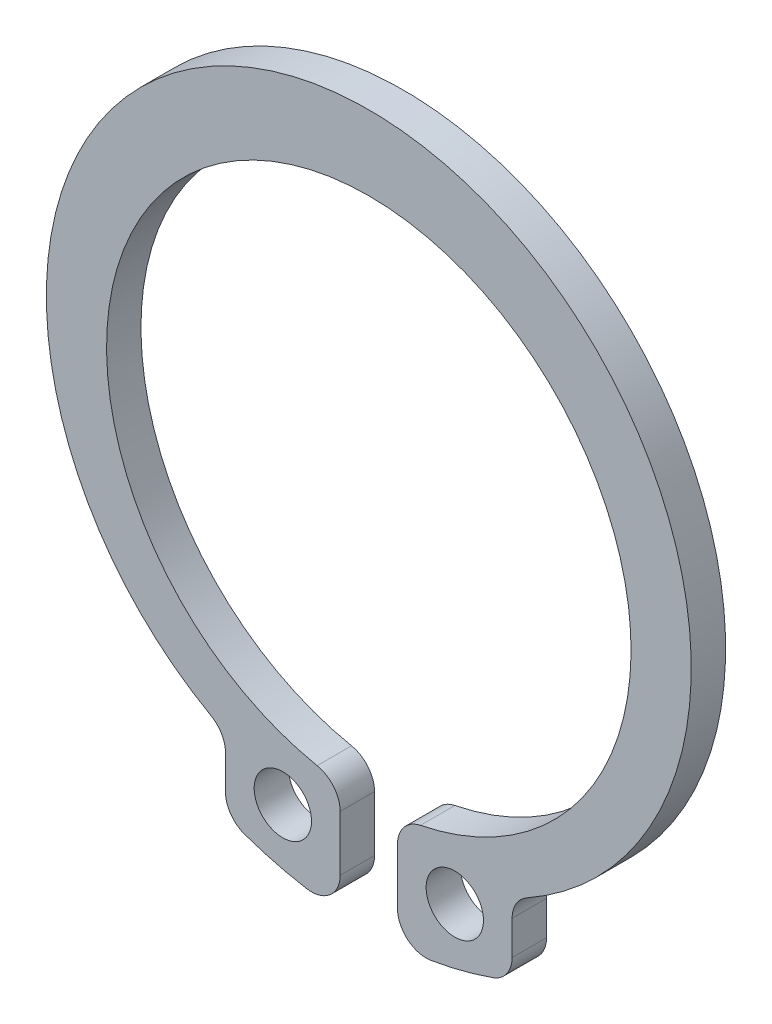
ISO-10303-21;
HEADER;
FILE_DESCRIPTION(('STEP AP214'),'2;1');
FILE_NAME('part.step','',(''),(''),'','','');
FILE_SCHEMA(('AUTOMOTIVE_DESIGN { 1 0 10303 214 1 1 1 1 }'));
ENDSEC;
DATA;
#1=APPLICATION_CONTEXT('core data for automotive mechanical design processes');
#2=APPLICATION_PROTOCOL_DEFINITION('international standard','automotive_design',2000,#1);
#3=PRODUCT_CONTEXT('',#1,'mechanical');
#4=PRODUCT('Part','Part','',(#3));
#5=PRODUCT_RELATED_PRODUCT_CATEGORY('part','',(#4));
#6=PRODUCT_DEFINITION_FORMATION('','',#4);
#7=PRODUCT_DEFINITION_CONTEXT('part definition',#1,'design');
#8=PRODUCT_DEFINITION('design','',#6,#7);
#9=PRODUCT_DEFINITION_SHAPE('','',#8);
#10=(LENGTH_UNIT() NAMED_UNIT(*) SI_UNIT(.MILLI.,.METRE.));
#11=(NAMED_UNIT(*) PLANE_ANGLE_UNIT() SI_UNIT($,.RADIAN.));
#12=(NAMED_UNIT(*) SI_UNIT($,.STERADIAN.) SOLID_ANGLE_UNIT());
#13=UNCERTAINTY_MEASURE_WITH_UNIT(LENGTH_MEASURE(1.E-05),#10,'distance_accuracy_value','');
#14=(GEOMETRIC_REPRESENTATION_CONTEXT(3) GLOBAL_UNCERTAINTY_ASSIGNED_CONTEXT((#13)) GLOBAL_UNIT_ASSIGNED_CONTEXT((#10,
#11,#12)) REPRESENTATION_CONTEXT('',''));
#15=CARTESIAN_POINT('',(0.,0.,0.));
#16=DIRECTION('',(0.,0.,1.));
#17=DIRECTION('',(1.,0.,0.));
#18=AXIS2_PLACEMENT_3D('',#15,#16,#17);
#19=CARTESIAN_POINT('',(0.,-0.582120503815602,1.2));
#20=DIRECTION('',(0.,0.,1.));
#21=DIRECTION('',(1.,0.,0.));
#22=AXIS2_PLACEMENT_3D('',#19,#20,#21);
#23=PLANE('',#22);
#24=CARTESIAN_POINT('',(-4.,-11.3667277613216,1.2));
#25=DIRECTION('',(0.,0.,1.));
#26=DIRECTION('',(1.,0.,0.));
#27=AXIS2_PLACEMENT_3D('',#24,#25,#26);
#28=CIRCLE('',#27,1.);
#29=CARTESIAN_POINT('',(-4.33195020746889,-12.3100246709749,1.2));
#30=VERTEX_POINT('',#29);
#31=CARTESIAN_POINT('',(-5.,-11.3667277613216,1.2));
#32=VERTEX_POINT('',#31);
#33=EDGE_CURVE('E217',#30,#32,#28,.F.);
#34=ORIENTED_EDGE('',*,*,#33,.F.);
#35=CARTESIAN_POINT('',(0.,0.,1.2));
#36=DIRECTION('',(0.,0.,1.));
#37=DIRECTION('',(1.,0.,0.));
#38=AXIS2_PLACEMENT_3D('',#35,#36,#37);
#39=CIRCLE('',#38,13.05);
#40=CARTESIAN_POINT('',(-2.16597510373444,-12.8689957591881,1.2));
#41=VERTEX_POINT('',#40);
#42=EDGE_CURVE('E214',#41,#30,#39,.F.);
#43=ORIENTED_EDGE('',*,*,#42,.F.);
#44=CARTESIAN_POINT('',(-2.,-11.8828658159553,1.2));
#45=DIRECTION('',(0.,0.,1.));
#46=DIRECTION('',(1.,0.,0.));
#47=AXIS2_PLACEMENT_3D('',#44,#45,#46);
#48=CIRCLE('',#47,1.);
#49=CARTESIAN_POINT('',(-0.999999999999999,-11.8828658159553,1.2));
#50=VERTEX_POINT('',#49);
#51=EDGE_CURVE('E211',#50,#41,#48,.F.);
#52=ORIENTED_EDGE('',*,*,#51,.F.);
#53=DIRECTION('',(0.,1.,0.));
#54=VECTOR('',#53,1.);
#55=CARTESIAN_POINT('',(-0.999999999999999,-11.8828658159553,1.2));
#56=LINE('',#55,#54);
#57=CARTESIAN_POINT('',(-0.999999999999999,-9.95100497437319,1.2));
#58=VERTEX_POINT('',#57);
#59=EDGE_CURVE('E144',#58,#50,#56,.F.);
#60=ORIENTED_EDGE('',*,*,#59,.F.);
#61=CARTESIAN_POINT('',(-2.,-9.95100497437319,1.2));
#62=DIRECTION('',(0.,0.,1.));
#63=DIRECTION('',(1.,0.,0.));
#64=AXIS2_PLACEMENT_3D('',#61,#62,#63);
#65=CIRCLE('',#64,1.);
#66=CARTESIAN_POINT('',(-1.80295566502463,-8.97061039561721,1.2));
#67=VERTEX_POINT('',#66);
#68=EDGE_CURVE('E140',#67,#58,#65,.F.);
#69=ORIENTED_EDGE('',*,*,#68,.F.);
#70=CARTESIAN_POINT('',(0.,0.,1.2));
#71=DIRECTION('',(0.,0.,1.));
#72=DIRECTION('',(1.,0.,0.));
#73=AXIS2_PLACEMENT_3D('',#70,#71,#72);
#74=CIRCLE('',#73,9.15);
#75=CARTESIAN_POINT('',(1.80295566502463,-8.97061039561721,1.2));
#76=VERTEX_POINT('',#75);
#77=EDGE_CURVE('E126',#67,#76,#74,.F.);
#78=ORIENTED_EDGE('',*,*,#77,.T.);
#79=CARTESIAN_POINT('',(2.,-9.95100497437319,1.2));
#80=DIRECTION('',(0.,0.,1.));
#81=DIRECTION('',(1.,0.,0.));
#82=AXIS2_PLACEMENT_3D('',#79,#80,#81);
#83=CIRCLE('',#82,1.);
#84=CARTESIAN_POINT('',(1.,-9.95100497437319,1.2));
#85=VERTEX_POINT('',#84);
#86=EDGE_CURVE('E136',#85,#76,#83,.F.);
#87=ORIENTED_EDGE('',*,*,#86,.F.);
#88=DIRECTION('',(0.,-1.,0.));
#89=VECTOR('',#88,1.);
#90=CARTESIAN_POINT('',(1.,-9.95100497437319,1.2));
#91=LINE('',#90,#89);
#92=CARTESIAN_POINT('',(1.,-11.8828658159553,1.2));
#93=VERTEX_POINT('',#92);
#94=EDGE_CURVE('E167',#93,#85,#91,.F.);
#95=ORIENTED_EDGE('',*,*,#94,.F.);
#96=CARTESIAN_POINT('',(2.,-11.8828658159553,1.2));
#97=DIRECTION('',(0.,0.,1.));
#98=DIRECTION('',(1.,0.,0.));
#99=AXIS2_PLACEMENT_3D('',#96,#97,#98);
#100=CIRCLE('',#99,0.999999999999999);
#101=CARTESIAN_POINT('',(2.16597510373444,-12.8689957591882,1.2));
#102=VERTEX_POINT('',#101);
#103=EDGE_CURVE('E235',#102,#93,#100,.F.);
#104=ORIENTED_EDGE('',*,*,#103,.F.);
#105=CARTESIAN_POINT('',(0.,0.,1.2));
#106=DIRECTION('',(0.,0.,1.));
#107=DIRECTION('',(1.,0.,0.));
#108=AXIS2_PLACEMENT_3D('',#105,#106,#107);
#109=CIRCLE('',#108,13.05);
#110=CARTESIAN_POINT('',(4.33195020746888,-12.3100246709749,1.2));
#111=VERTEX_POINT('',#110);
#112=EDGE_CURVE('E232',#111,#102,#109,.F.);
#113=ORIENTED_EDGE('',*,*,#112,.F.);
#114=CARTESIAN_POINT('',(4.,-11.3667277613216,1.2));
#115=DIRECTION('',(0.,0.,1.));
#116=DIRECTION('',(1.,0.,0.));
#117=AXIS2_PLACEMENT_3D('',#114,#115,#116);
#118=CIRCLE('',#117,1.);
#119=CARTESIAN_POINT('',(5.,-11.3667277613216,1.2));
#120=VERTEX_POINT('',#119);
#121=EDGE_CURVE('E229',#120,#111,#118,.F.);
#122=ORIENTED_EDGE('',*,*,#121,.F.);
#123=DIRECTION('',(0.,1.,0.));
#124=VECTOR('',#123,1.);
#125=CARTESIAN_POINT('',(5.,-11.3667277613216,1.2));
#126=LINE('',#125,#124);
#127=CARTESIAN_POINT('',(5.,-10.1800046816469,1.2));
#128=VERTEX_POINT('',#127);
#129=EDGE_CURVE('E163',#128,#120,#126,.F.);
#130=ORIENTED_EDGE('',*,*,#129,.F.);
#131=CARTESIAN_POINT('',(6.,-10.1800046816469,1.2));
#132=DIRECTION('',(0.,0.,1.));
#133=DIRECTION('',(1.,0.,0.));
#134=AXIS2_PLACEMENT_3D('',#131,#132,#133);
#135=CIRCLE('',#134,1.);
#136=CARTESIAN_POINT('',(5.51020408163266,-9.30816756477778,1.2));
#137=VERTEX_POINT('',#136);
#138=EDGE_CURVE('E225',#128,#137,#135,.F.);
#139=ORIENTED_EDGE('',*,*,#138,.T.);
#140=CARTESIAN_POINT('',(0.,0.5,1.2));
#141=DIRECTION('',(0.,0.,1.));
#142=DIRECTION('',(1.,0.,0.));
#143=AXIS2_PLACEMENT_3D('',#140,#141,#142);
#144=CIRCLE('',#143,11.25);
#145=CARTESIAN_POINT('',(-5.51020408163265,-9.30816756477777,1.2));
#146=VERTEX_POINT('',#145);
#147=EDGE_CURVE('E222',#146,#137,#144,.F.);
#148=ORIENTED_EDGE('',*,*,#147,.F.);
#149=CARTESIAN_POINT('',(-6.,-10.1800046816469,1.2));
#150=DIRECTION('',(0.,0.,1.));
#151=DIRECTION('',(1.,0.,0.));
#152=AXIS2_PLACEMENT_3D('',#149,#150,#151);
#153=CIRCLE('',#152,1.);
#154=CARTESIAN_POINT('',(-5.,-10.1800046816469,1.2));
#155=VERTEX_POINT('',#154);
#156=EDGE_CURVE('E162',#146,#155,#153,.F.);
#157=ORIENTED_EDGE('',*,*,#156,.T.);
#158=DIRECTION('',(0.,-1.,0.));
#159=VECTOR('',#158,1.);
#160=CARTESIAN_POINT('',(-5.,-10.1800046816469,1.2));
#161=LINE('',#160,#159);
#162=EDGE_CURVE('E159',#32,#155,#161,.F.);
#163=ORIENTED_EDGE('',*,*,#162,.F.);
#164=EDGE_LOOP('',(#34,#43,#52,#60,#69,#78,#87,#95,#104,#113,#122,#130,#139,#148,#157,#163));
#165=FACE_BOUND('',#164,.T.);
#166=CARTESIAN_POINT('',(3.,-10.75,1.2));
#167=DIRECTION('',(0.,0.,1.));
#168=DIRECTION('',(1.,0.,0.));
#169=AXIS2_PLACEMENT_3D('',#166,#167,#168);
#170=CIRCLE('',#169,1.);
#171=CARTESIAN_POINT('',(4.,-10.75,1.2));
#172=VERTEX_POINT('',#171);
#173=EDGE_CURVE('E148',#172,#172,#170,.F.);
#174=ORIENTED_EDGE('',*,*,#173,.T.);
#175=EDGE_LOOP('',(#174));
#176=FACE_BOUND('',#175,.T.);
#177=CARTESIAN_POINT('',(-3.,-10.75,1.2));
#178=DIRECTION('',(0.,0.,1.));
#179=DIRECTION('',(1.,0.,0.));
#180=AXIS2_PLACEMENT_3D('',#177,#178,#179);
#181=CIRCLE('',#180,1.);
#182=CARTESIAN_POINT('',(-2.,-10.75,1.2));
#183=VERTEX_POINT('',#182);
#184=EDGE_CURVE('E20',#183,#183,#181,.F.);
#185=ORIENTED_EDGE('',*,*,#184,.T.);
#186=EDGE_LOOP('',(#185));
#187=FACE_BOUND('',#186,.T.);
#188=ADVANCED_FACE('F17',(#165,#176,#187),#23,.T.);
#189=CARTESIAN_POINT('',(-3.,-10.75,0.));
#190=DIRECTION('',(0.,0.,1.));
#191=DIRECTION('',(1.,0.,0.));
#192=AXIS2_PLACEMENT_3D('',#189,#190,#191);
#193=CYLINDRICAL_SURFACE('',#192,1.);
#194=ORIENTED_EDGE('',*,*,#184,.F.);
#195=EDGE_LOOP('',(#194));
#196=FACE_BOUND('',#195,.T.);
#197=CARTESIAN_POINT('',(-3.,-10.75,0.));
#198=DIRECTION('',(0.,0.,1.));
#199=DIRECTION('',(1.,0.,0.));
#200=AXIS2_PLACEMENT_3D('',#197,#198,#199);
#201=CIRCLE('',#200,1.);
#202=CARTESIAN_POINT('',(-2.,-10.75,0.));
#203=VERTEX_POINT('',#202);
#204=EDGE_CURVE('E207',#203,#203,#201,.F.);
#205=ORIENTED_EDGE('',*,*,#204,.T.);
#206=EDGE_LOOP('',(#205));
#207=FACE_BOUND('',#206,.T.);
#208=ADVANCED_FACE('F243',(#196,#207),#193,.F.);
#209=CARTESIAN_POINT('',(3.,-10.75,0.));
#210=DIRECTION('',(0.,0.,1.));
#211=DIRECTION('',(1.,0.,0.));
#212=AXIS2_PLACEMENT_3D('',#209,#210,#211);
#213=CYLINDRICAL_SURFACE('',#212,1.);
#214=ORIENTED_EDGE('',*,*,#173,.F.);
#215=EDGE_LOOP('',(#214));
#216=FACE_BOUND('',#215,.T.);
#217=CARTESIAN_POINT('',(3.,-10.75,0.));
#218=DIRECTION('',(0.,0.,1.));
#219=DIRECTION('',(1.,0.,0.));
#220=AXIS2_PLACEMENT_3D('',#217,#218,#219);
#221=CIRCLE('',#220,1.);
#222=CARTESIAN_POINT('',(4.,-10.75,0.));
#223=VERTEX_POINT('',#222);
#224=EDGE_CURVE('E204',#223,#223,#221,.F.);
#225=ORIENTED_EDGE('',*,*,#224,.T.);
#226=EDGE_LOOP('',(#225));
#227=FACE_BOUND('',#226,.T.);
#228=ADVANCED_FACE('F246',(#216,#227),#213,.F.);
#229=CARTESIAN_POINT('',(-2.,-9.95100497437319,0.));
#230=DIRECTION('',(0.,0.,1.));
#231=DIRECTION('',(1.,0.,0.));
#232=AXIS2_PLACEMENT_3D('',#229,#230,#231);
#233=CYLINDRICAL_SURFACE('',#232,1.);
#234=CARTESIAN_POINT('',(-2.,-9.95100497437319,0.));
#235=DIRECTION('',(0.,0.,1.));
#236=DIRECTION('',(1.,0.,0.));
#237=AXIS2_PLACEMENT_3D('',#234,#235,#236);
#238=CIRCLE('',#237,1.);
#239=CARTESIAN_POINT('',(-0.999999999999999,-9.95100497437319,0.));
#240=VERTEX_POINT('',#239);
#241=CARTESIAN_POINT('',(-1.80295566502463,-8.97061039561721,0.));
#242=VERTEX_POINT('',#241);
#243=EDGE_CURVE('E152',#240,#242,#238,.T.);
#244=ORIENTED_EDGE('',*,*,#243,.T.);
#245=DIRECTION('',(0.,0.,1.));
#246=VECTOR('',#245,1.);
#247=CARTESIAN_POINT('',(-1.80295566502464,-8.97061039561721,0.));
#248=LINE('',#247,#246);
#249=EDGE_CURVE('E130',#242,#67,#248,.T.);
#250=ORIENTED_EDGE('',*,*,#249,.T.);
#251=ORIENTED_EDGE('',*,*,#68,.T.);
#252=DIRECTION('',(0.,0.,1.));
#253=VECTOR('',#252,1.);
#254=CARTESIAN_POINT('',(-0.999999999999999,-9.95100497437319,0.));
#255=LINE('',#254,#253);
#256=EDGE_CURVE('E210',#240,#58,#255,.T.);
#257=ORIENTED_EDGE('',*,*,#256,.F.);
#258=EDGE_LOOP('',(#244,#250,#251,#257));
#259=FACE_BOUND('',#258,.T.);
#260=ADVANCED_FACE('F151',(#259),#233,.T.);
#261=CARTESIAN_POINT('',(0.,0.,0.));
#262=DIRECTION('',(0.,0.,1.));
#263=DIRECTION('',(1.,0.,0.));
#264=AXIS2_PLACEMENT_3D('',#261,#262,#263);
#265=CYLINDRICAL_SURFACE('',#264,9.15);
#266=CARTESIAN_POINT('',(0.,0.,0.));
#267=DIRECTION('',(0.,0.,1.));
#268=DIRECTION('',(1.,0.,0.));
#269=AXIS2_PLACEMENT_3D('',#266,#267,#268);
#270=CIRCLE('',#269,9.15);
#271=CARTESIAN_POINT('',(1.80295566502463,-8.97061039561721,0.));
#272=VERTEX_POINT('',#271);
#273=EDGE_CURVE('E201',#242,#272,#270,.F.);
#274=ORIENTED_EDGE('',*,*,#273,.T.);
#275=DIRECTION('',(0.,0.,1.));
#276=VECTOR('',#275,1.);
#277=CARTESIAN_POINT('',(1.80295566502463,-8.97061039561721,0.));
#278=LINE('',#277,#276);
#279=EDGE_CURVE('E133',#76,#272,#278,.F.);
#280=ORIENTED_EDGE('',*,*,#279,.F.);
#281=ORIENTED_EDGE('',*,*,#77,.F.);
#282=ORIENTED_EDGE('',*,*,#249,.F.);
#283=EDGE_LOOP('',(#274,#280,#281,#282));
#284=FACE_BOUND('',#283,.T.);
#285=ADVANCED_FACE('F128',(#284),#265,.F.);
#286=CARTESIAN_POINT('',(2.,-9.95100497437319,0.));
#287=DIRECTION('',(0.,0.,1.));
#288=DIRECTION('',(1.,0.,0.));
#289=AXIS2_PLACEMENT_3D('',#286,#287,#288);
#290=CYLINDRICAL_SURFACE('',#289,1.);
#291=CARTESIAN_POINT('',(2.,-9.95100497437319,0.));
#292=DIRECTION('',(0.,0.,1.));
#293=DIRECTION('',(1.,0.,0.));
#294=AXIS2_PLACEMENT_3D('',#291,#292,#293);
#295=CIRCLE('',#294,1.);
#296=CARTESIAN_POINT('',(1.,-9.95100497437319,0.));
#297=VERTEX_POINT('',#296);
#298=EDGE_CURVE('E198',#272,#297,#295,.T.);
#299=ORIENTED_EDGE('',*,*,#298,.T.);
#300=DIRECTION('',(0.,0.,1.));
#301=VECTOR('',#300,1.);
#302=CARTESIAN_POINT('',(1.,-9.95100497437319,0.));
#303=LINE('',#302,#301);
#304=EDGE_CURVE('E169',#85,#297,#303,.F.);
#305=ORIENTED_EDGE('',*,*,#304,.F.);
#306=ORIENTED_EDGE('',*,*,#86,.T.);
#307=ORIENTED_EDGE('',*,*,#279,.T.);
#308=EDGE_LOOP('',(#299,#305,#306,#307));
#309=FACE_BOUND('',#308,.T.);
#310=ADVANCED_FACE('F309',(#309),#290,.T.);
#311=CARTESIAN_POINT('',(1.,-9.95100497437319,0.));
#312=DIRECTION('',(-1.,0.,0.));
#313=DIRECTION('',(0.,-1.,0.));
#314=AXIS2_PLACEMENT_3D('',#311,#312,#313);
#315=PLANE('',#314);
#316=DIRECTION('',(0.,1.,0.));
#317=VECTOR('',#316,1.);
#318=CARTESIAN_POINT('',(1.,-0.582120503815602,0.));
#319=LINE('',#318,#317);
#320=CARTESIAN_POINT('',(1.,-11.8828658159553,0.));
#321=VERTEX_POINT('',#320);
#322=EDGE_CURVE('E197',#297,#321,#319,.F.);
#323=ORIENTED_EDGE('',*,*,#322,.T.);
#324=DIRECTION('',(0.,0.,1.));
#325=VECTOR('',#324,1.);
#326=CARTESIAN_POINT('',(1.,-11.8828658159553,0.));
#327=LINE('',#326,#325);
#328=EDGE_CURVE('E234',#93,#321,#327,.F.);
#329=ORIENTED_EDGE('',*,*,#328,.F.);
#330=ORIENTED_EDGE('',*,*,#94,.T.);
#331=ORIENTED_EDGE('',*,*,#304,.T.);
#332=EDGE_LOOP('',(#323,#329,#330,#331));
#333=FACE_BOUND('',#332,.T.);
#334=ADVANCED_FACE('F305',(#333),#315,.T.);
#335=CARTESIAN_POINT('',(2.,-11.8828658159553,0.));
#336=DIRECTION('',(0.,0.,1.));
#337=DIRECTION('',(1.,0.,0.));
#338=AXIS2_PLACEMENT_3D('',#335,#336,#337);
#339=CYLINDRICAL_SURFACE('',#338,0.999999999999999);
#340=CARTESIAN_POINT('',(2.,-11.8828658159553,0.));
#341=DIRECTION('',(0.,0.,1.));
#342=DIRECTION('',(1.,0.,0.));
#343=AXIS2_PLACEMENT_3D('',#340,#341,#342);
#344=CIRCLE('',#343,0.999999999999999);
#345=CARTESIAN_POINT('',(2.16597510373444,-12.8689957591882,0.));
#346=VERTEX_POINT('',#345);
#347=EDGE_CURVE('E194',#321,#346,#344,.T.);
#348=ORIENTED_EDGE('',*,*,#347,.T.);
#349=DIRECTION('',(0.,0.,1.));
#350=VECTOR('',#349,1.);
#351=CARTESIAN_POINT('',(2.16597510373444,-12.8689957591882,0.));
#352=LINE('',#351,#350);
#353=EDGE_CURVE('E231',#102,#346,#352,.F.);
#354=ORIENTED_EDGE('',*,*,#353,.F.);
#355=ORIENTED_EDGE('',*,*,#103,.T.);
#356=ORIENTED_EDGE('',*,*,#328,.T.);
#357=EDGE_LOOP('',(#348,#354,#355,#356));
#358=FACE_BOUND('',#357,.T.);
#359=ADVANCED_FACE('F301',(#358),#339,.T.);
#360=CARTESIAN_POINT('',(0.,0.,0.));
#361=DIRECTION('',(0.,0.,1.));
#362=DIRECTION('',(1.,0.,0.));
#363=AXIS2_PLACEMENT_3D('',#360,#361,#362);
#364=CYLINDRICAL_SURFACE('',#363,13.05);
#365=CARTESIAN_POINT('',(0.,0.,0.));
#366=DIRECTION('',(0.,0.,1.));
#367=DIRECTION('',(1.,0.,0.));
#368=AXIS2_PLACEMENT_3D('',#365,#366,#367);
#369=CIRCLE('',#368,13.05);
#370=CARTESIAN_POINT('',(4.33195020746888,-12.3100246709749,0.));
#371=VERTEX_POINT('',#370);
#372=EDGE_CURVE('E191',#346,#371,#369,.T.);
#373=ORIENTED_EDGE('',*,*,#372,.T.);
#374=DIRECTION('',(0.,0.,1.));
#375=VECTOR('',#374,1.);
#376=CARTESIAN_POINT('',(4.33195020746887,-12.3100246709749,0.));
#377=LINE('',#376,#375);
#378=EDGE_CURVE('E166',#111,#371,#377,.F.);
#379=ORIENTED_EDGE('',*,*,#378,.F.);
#380=ORIENTED_EDGE('',*,*,#112,.T.);
#381=ORIENTED_EDGE('',*,*,#353,.T.);
#382=EDGE_LOOP('',(#373,#379,#380,#381));
#383=FACE_BOUND('',#382,.T.);
#384=ADVANCED_FACE('F297',(#383),#364,.T.);
#385=CARTESIAN_POINT('',(4.,-11.3667277613216,0.));
#386=DIRECTION('',(0.,0.,1.));
#387=DIRECTION('',(1.,0.,0.));
#388=AXIS2_PLACEMENT_3D('',#385,#386,#387);
#389=CYLINDRICAL_SURFACE('',#388,1.);
#390=CARTESIAN_POINT('',(4.,-11.3667277613216,0.));
#391=DIRECTION('',(0.,0.,1.));
#392=DIRECTION('',(1.,0.,0.));
#393=AXIS2_PLACEMENT_3D('',#390,#391,#392);
#394=CIRCLE('',#393,1.);
#395=CARTESIAN_POINT('',(5.,-11.3667277613216,0.));
#396=VERTEX_POINT('',#395);
#397=EDGE_CURVE('E188',#371,#396,#394,.T.);
#398=ORIENTED_EDGE('',*,*,#397,.T.);
#399=DIRECTION('',(0.,0.,1.));
#400=VECTOR('',#399,1.);
#401=CARTESIAN_POINT('',(5.,-11.3667277613216,0.));
#402=LINE('',#401,#400);
#403=EDGE_CURVE('E165',#120,#396,#402,.F.);
#404=ORIENTED_EDGE('',*,*,#403,.F.);
#405=ORIENTED_EDGE('',*,*,#121,.T.);
#406=ORIENTED_EDGE('',*,*,#378,.T.);
#407=EDGE_LOOP('',(#398,#404,#405,#406));
#408=FACE_BOUND('',#407,.T.);
#409=ADVANCED_FACE('F293',(#408),#389,.T.);
#410=CARTESIAN_POINT('',(5.,-11.3667277613216,0.));
#411=DIRECTION('',(1.,0.,0.));
#412=DIRECTION('',(0.,1.,0.));
#413=AXIS2_PLACEMENT_3D('',#410,#411,#412);
#414=PLANE('',#413);
#415=DIRECTION('',(0.,1.,0.));
#416=VECTOR('',#415,1.);
#417=CARTESIAN_POINT('',(5.,-0.582120503815602,0.));
#418=LINE('',#417,#416);
#419=CARTESIAN_POINT('',(5.,-10.1800046816469,0.));
#420=VERTEX_POINT('',#419);
#421=EDGE_CURVE('E187',#396,#420,#418,.T.);
#422=ORIENTED_EDGE('',*,*,#421,.T.);
#423=DIRECTION('',(0.,0.,1.));
#424=VECTOR('',#423,1.);
#425=CARTESIAN_POINT('',(5.,-10.1800046816469,0.));
#426=LINE('',#425,#424);
#427=EDGE_CURVE('E228',#420,#128,#426,.T.);
#428=ORIENTED_EDGE('',*,*,#427,.T.);
#429=ORIENTED_EDGE('',*,*,#129,.T.);
#430=ORIENTED_EDGE('',*,*,#403,.T.);
#431=EDGE_LOOP('',(#422,#428,#429,#430));
#432=FACE_BOUND('',#431,.T.);
#433=ADVANCED_FACE('F289',(#432),#414,.T.);
#434=CARTESIAN_POINT('',(6.,-10.1800046816469,0.));
#435=DIRECTION('',(0.,0.,1.));
#436=DIRECTION('',(1.,0.,0.));
#437=AXIS2_PLACEMENT_3D('',#434,#435,#436);
#438=CYLINDRICAL_SURFACE('',#437,1.);
#439=ORIENTED_EDGE('',*,*,#138,.F.);
#440=ORIENTED_EDGE('',*,*,#427,.F.);
#441=CARTESIAN_POINT('',(6.,-10.1800046816469,0.));
#442=DIRECTION('',(0.,0.,1.));
#443=DIRECTION('',(1.,0.,0.));
#444=AXIS2_PLACEMENT_3D('',#441,#442,#443);
#445=CIRCLE('',#444,1.);
#446=CARTESIAN_POINT('',(5.51020408163266,-9.30816756477778,0.));
#447=VERTEX_POINT('',#446);
#448=EDGE_CURVE('E184',#420,#447,#445,.F.);
#449=ORIENTED_EDGE('',*,*,#448,.T.);
#450=DIRECTION('',(0.,0.,1.));
#451=VECTOR('',#450,1.);
#452=CARTESIAN_POINT('',(5.51020408163265,-9.30816756477778,0.));
#453=LINE('',#452,#451);
#454=EDGE_CURVE('E224',#137,#447,#453,.F.);
#455=ORIENTED_EDGE('',*,*,#454,.F.);
#456=EDGE_LOOP('',(#439,#440,#449,#455));
#457=FACE_BOUND('',#456,.T.);
#458=ADVANCED_FACE('F285',(#457),#438,.F.);
#459=CARTESIAN_POINT('',(0.,0.5,0.));
#460=DIRECTION('',(0.,0.,1.));
#461=DIRECTION('',(1.,0.,0.));
#462=AXIS2_PLACEMENT_3D('',#459,#460,#461);
#463=CYLINDRICAL_SURFACE('',#462,11.25);
#464=DIRECTION('',(0.,0.,1.));
#465=VECTOR('',#464,1.);
#466=CARTESIAN_POINT('',(-5.51020408163265,-9.30816756477777,0.));
#467=LINE('',#466,#465);
#468=CARTESIAN_POINT('',(-5.51020408163265,-9.30816756477777,0.));
#469=VERTEX_POINT('',#468);
#470=EDGE_CURVE('E221',#469,#146,#467,.T.);
#471=ORIENTED_EDGE('',*,*,#470,.T.);
#472=ORIENTED_EDGE('',*,*,#147,.T.);
#473=ORIENTED_EDGE('',*,*,#454,.T.);
#474=CARTESIAN_POINT('',(0.,0.5,0.));
#475=DIRECTION('',(0.,0.,1.));
#476=DIRECTION('',(1.,0.,0.));
#477=AXIS2_PLACEMENT_3D('',#474,#475,#476);
#478=CIRCLE('',#477,11.25);
#479=EDGE_CURVE('E182',#447,#469,#478,.T.);
#480=ORIENTED_EDGE('',*,*,#479,.T.);
#481=EDGE_LOOP('',(#471,#472,#473,#480));
#482=FACE_BOUND('',#481,.T.);
#483=ADVANCED_FACE('F281',(#482),#463,.T.);
#484=CARTESIAN_POINT('',(-6.,-10.1800046816469,0.));
#485=DIRECTION('',(0.,0.,1.));
#486=DIRECTION('',(1.,0.,0.));
#487=AXIS2_PLACEMENT_3D('',#484,#485,#486);
#488=CYLINDRICAL_SURFACE('',#487,1.);
#489=ORIENTED_EDGE('',*,*,#156,.F.);
#490=ORIENTED_EDGE('',*,*,#470,.F.);
#491=CARTESIAN_POINT('',(-6.,-10.1800046816469,0.));
#492=DIRECTION('',(0.,0.,1.));
#493=DIRECTION('',(1.,0.,0.));
#494=AXIS2_PLACEMENT_3D('',#491,#492,#493);
#495=CIRCLE('',#494,1.);
#496=CARTESIAN_POINT('',(-5.,-10.1800046816469,0.));
#497=VERTEX_POINT('',#496);
#498=EDGE_CURVE('E179',#469,#497,#495,.F.);
#499=ORIENTED_EDGE('',*,*,#498,.T.);
#500=DIRECTION('',(0.,0.,1.));
#501=VECTOR('',#500,1.);
#502=CARTESIAN_POINT('',(-5.,-10.1800046816469,0.));
#503=LINE('',#502,#501);
#504=EDGE_CURVE('E161',#155,#497,#503,.F.);
#505=ORIENTED_EDGE('',*,*,#504,.F.);
#506=EDGE_LOOP('',(#489,#490,#499,#505));
#507=FACE_BOUND('',#506,.T.);
#508=ADVANCED_FACE('F277',(#507),#488,.F.);
#509=CARTESIAN_POINT('',(-5.,-10.1800046816469,0.));
#510=DIRECTION('',(-1.,0.,0.));
#511=DIRECTION('',(0.,-1.,0.));
#512=AXIS2_PLACEMENT_3D('',#509,#510,#511);
#513=PLANE('',#512);
#514=DIRECTION('',(0.,1.,0.));
#515=VECTOR('',#514,1.);
#516=CARTESIAN_POINT('',(-5.,-0.582120503815602,0.));
#517=LINE('',#516,#515);
#518=CARTESIAN_POINT('',(-5.,-11.3667277613216,0.));
#519=VERTEX_POINT('',#518);
#520=EDGE_CURVE('E178',#497,#519,#517,.F.);
#521=ORIENTED_EDGE('',*,*,#520,.T.);
#522=DIRECTION('',(0.,0.,1.));
#523=VECTOR('',#522,1.);
#524=CARTESIAN_POINT('',(-5.,-11.3667277613216,0.));
#525=LINE('',#524,#523);
#526=EDGE_CURVE('E216',#32,#519,#525,.F.);
#527=ORIENTED_EDGE('',*,*,#526,.F.);
#528=ORIENTED_EDGE('',*,*,#162,.T.);
#529=ORIENTED_EDGE('',*,*,#504,.T.);
#530=EDGE_LOOP('',(#521,#527,#528,#529));
#531=FACE_BOUND('',#530,.T.);
#532=ADVANCED_FACE('F273',(#531),#513,.T.);
#533=CARTESIAN_POINT('',(-4.,-11.3667277613216,0.));
#534=DIRECTION('',(0.,0.,1.));
#535=DIRECTION('',(1.,0.,0.));
#536=AXIS2_PLACEMENT_3D('',#533,#534,#535);
#537=CYLINDRICAL_SURFACE('',#536,1.);
#538=CARTESIAN_POINT('',(-4.,-11.3667277613216,0.));
#539=DIRECTION('',(0.,0.,1.));
#540=DIRECTION('',(1.,0.,0.));
#541=AXIS2_PLACEMENT_3D('',#538,#539,#540);
#542=CIRCLE('',#541,1.);
#543=CARTESIAN_POINT('',(-4.33195020746889,-12.3100246709749,0.));
#544=VERTEX_POINT('',#543);
#545=EDGE_CURVE('E175',#519,#544,#542,.T.);
#546=ORIENTED_EDGE('',*,*,#545,.T.);
#547=DIRECTION('',(0.,0.,1.));
#548=VECTOR('',#547,1.);
#549=CARTESIAN_POINT('',(-4.33195020746889,-12.3100246709749,0.));
#550=LINE('',#549,#548);
#551=EDGE_CURVE('E213',#30,#544,#550,.F.);
#552=ORIENTED_EDGE('',*,*,#551,.F.);
#553=ORIENTED_EDGE('',*,*,#33,.T.);
#554=ORIENTED_EDGE('',*,*,#526,.T.);
#555=EDGE_LOOP('',(#546,#552,#553,#554));
#556=FACE_BOUND('',#555,.T.);
#557=ADVANCED_FACE('F269',(#556),#537,.T.);
#558=CARTESIAN_POINT('',(0.,0.,0.));
#559=DIRECTION('',(0.,0.,1.));
#560=DIRECTION('',(1.,0.,0.));
#561=AXIS2_PLACEMENT_3D('',#558,#559,#560);
#562=CYLINDRICAL_SURFACE('',#561,13.05);
#563=CARTESIAN_POINT('',(0.,0.,0.));
#564=DIRECTION('',(0.,0.,1.));
#565=DIRECTION('',(1.,0.,0.));
#566=AXIS2_PLACEMENT_3D('',#563,#564,#565);
#567=CIRCLE('',#566,13.05);
#568=CARTESIAN_POINT('',(-2.16597510373444,-12.8689957591881,0.));
#569=VERTEX_POINT('',#568);
#570=EDGE_CURVE('E172',#544,#569,#567,.T.);
#571=ORIENTED_EDGE('',*,*,#570,.T.);
#572=DIRECTION('',(0.,0.,1.));
#573=VECTOR('',#572,1.);
#574=CARTESIAN_POINT('',(-2.16597510373443,-12.8689957591881,0.));
#575=LINE('',#574,#573);
#576=EDGE_CURVE('E158',#41,#569,#575,.F.);
#577=ORIENTED_EDGE('',*,*,#576,.F.);
#578=ORIENTED_EDGE('',*,*,#42,.T.);
#579=ORIENTED_EDGE('',*,*,#551,.T.);
#580=EDGE_LOOP('',(#571,#577,#578,#579));
#581=FACE_BOUND('',#580,.T.);
#582=ADVANCED_FACE('F265',(#581),#562,.T.);
#583=CARTESIAN_POINT('',(-2.,-11.8828658159553,0.));
#584=DIRECTION('',(0.,0.,1.));
#585=DIRECTION('',(1.,0.,0.));
#586=AXIS2_PLACEMENT_3D('',#583,#584,#585);
#587=CYLINDRICAL_SURFACE('',#586,1.);
#588=CARTESIAN_POINT('',(-2.,-11.8828658159553,0.));
#589=DIRECTION('',(0.,0.,1.));
#590=DIRECTION('',(1.,0.,0.));
#591=AXIS2_PLACEMENT_3D('',#588,#589,#590);
#592=CIRCLE('',#591,1.);
#593=CARTESIAN_POINT('',(-0.999999999999999,-11.8828658159553,0.));
#594=VERTEX_POINT('',#593);
#595=EDGE_CURVE('E26',#569,#594,#592,.T.);
#596=ORIENTED_EDGE('',*,*,#595,.T.);
#597=DIRECTION('',(0.,0.,1.));
#598=VECTOR('',#597,1.);
#599=CARTESIAN_POINT('',(-0.999999999999999,-11.8828658159553,0.));
#600=LINE('',#599,#598);
#601=EDGE_CURVE('E34',#50,#594,#600,.F.);
#602=ORIENTED_EDGE('',*,*,#601,.F.);
#603=ORIENTED_EDGE('',*,*,#51,.T.);
#604=ORIENTED_EDGE('',*,*,#576,.T.);
#605=EDGE_LOOP('',(#596,#602,#603,#604));
#606=FACE_BOUND('',#605,.T.);
#607=ADVANCED_FACE('F258',(#606),#587,.T.);
#608=CARTESIAN_POINT('',(-0.999999999999999,-11.8828658159553,0.));
#609=DIRECTION('',(1.,0.,0.));
#610=DIRECTION('',(0.,1.,0.));
#611=AXIS2_PLACEMENT_3D('',#608,#609,#610);
#612=PLANE('',#611);
#613=DIRECTION('',(0.,1.,0.));
#614=VECTOR('',#613,1.);
#615=CARTESIAN_POINT('',(-0.999999999999999,-0.582120503815602,0.));
#616=LINE('',#615,#614);
#617=EDGE_CURVE('E11',#594,#240,#616,.T.);
#618=ORIENTED_EDGE('',*,*,#617,.T.);
#619=ORIENTED_EDGE('',*,*,#256,.T.);
#620=ORIENTED_EDGE('',*,*,#59,.T.);
#621=ORIENTED_EDGE('',*,*,#601,.T.);
#622=EDGE_LOOP('',(#618,#619,#620,#621));
#623=FACE_BOUND('',#622,.T.);
#624=ADVANCED_FACE('F251',(#623),#612,.T.);
#625=CARTESIAN_POINT('',(0.,-0.582120503815602,0.));
#626=DIRECTION('',(0.,0.,1.));
#627=DIRECTION('',(1.,0.,0.));
#628=AXIS2_PLACEMENT_3D('',#625,#626,#627);
#629=PLANE('',#628);
#630=ORIENTED_EDGE('',*,*,#595,.F.);
#631=ORIENTED_EDGE('',*,*,#570,.F.);
#632=ORIENTED_EDGE('',*,*,#545,.F.);
#633=ORIENTED_EDGE('',*,*,#520,.F.);
#634=ORIENTED_EDGE('',*,*,#498,.F.);
#635=ORIENTED_EDGE('',*,*,#479,.F.);
#636=ORIENTED_EDGE('',*,*,#448,.F.);
#637=ORIENTED_EDGE('',*,*,#421,.F.);
#638=ORIENTED_EDGE('',*,*,#397,.F.);
#639=ORIENTED_EDGE('',*,*,#372,.F.);
#640=ORIENTED_EDGE('',*,*,#347,.F.);
#641=ORIENTED_EDGE('',*,*,#322,.F.);
#642=ORIENTED_EDGE('',*,*,#298,.F.);
#643=ORIENTED_EDGE('',*,*,#273,.F.);
#644=ORIENTED_EDGE('',*,*,#243,.F.);
#645=ORIENTED_EDGE('',*,*,#617,.F.);
#646=EDGE_LOOP('',(#630,#631,#632,#633,#634,#635,#636,#637,#638,#639,#640,#641,#642,#643,#644,#645));
#647=FACE_BOUND('',#646,.T.);
#648=ORIENTED_EDGE('',*,*,#224,.F.);
#649=EDGE_LOOP('',(#648));
#650=FACE_BOUND('',#649,.T.);
#651=ORIENTED_EDGE('',*,*,#204,.F.);
#652=EDGE_LOOP('',(#651));
#653=FACE_BOUND('',#652,.T.);
#654=ADVANCED_FACE('F249',(#647,#650,#653),#629,.F.);
#655=CLOSED_SHELL('',(#188,#208,#228,#260,#285,#310,#334,#359,#384,#409,#433,#458,#483,#508,
#532,#557,#582,#607,#624,#654));
#656=MANIFOLD_SOLID_BREP('B1',#655);
#657=ADVANCED_BREP_SHAPE_REPRESENTATION('',(#18,#656),#14);
#658=SHAPE_DEFINITION_REPRESENTATION(#9,#657);
ENDSEC;
END-ISO-10303-21;
